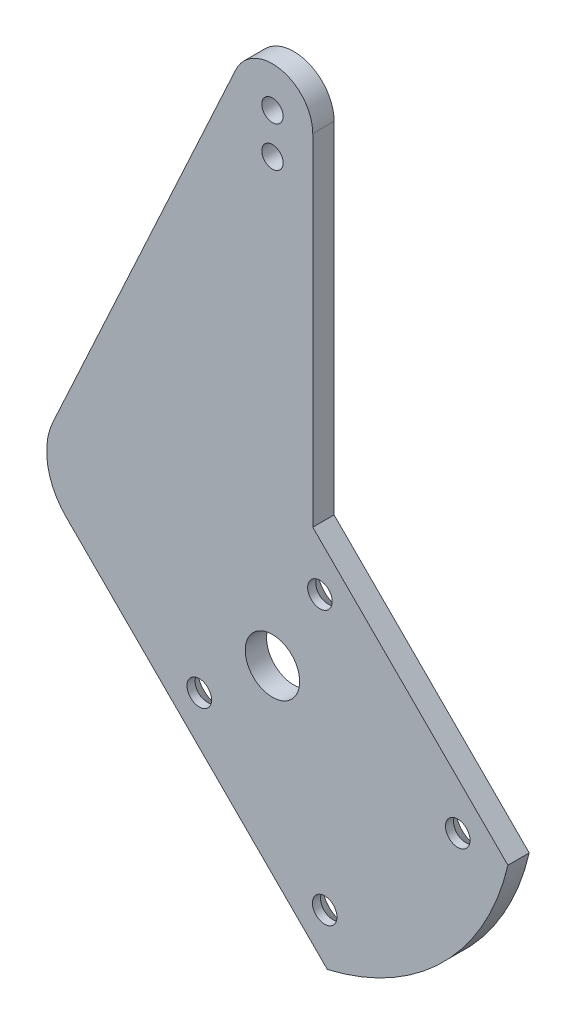
ISO-10303-21;
HEADER;
FILE_DESCRIPTION(('STEP AP214'),'2;1');
FILE_NAME('part.step','',(''),(''),'','','');
FILE_SCHEMA(('AUTOMOTIVE_DESIGN { 1 0 10303 214 1 1 1 1 }'));
ENDSEC;
DATA;
#1=APPLICATION_CONTEXT('core data for automotive mechanical design processes');
#2=APPLICATION_PROTOCOL_DEFINITION('international standard','automotive_design',2000,#1);
#3=PRODUCT_CONTEXT('',#1,'mechanical');
#4=PRODUCT('Part','Part','',(#3));
#5=PRODUCT_RELATED_PRODUCT_CATEGORY('part','',(#4));
#6=PRODUCT_DEFINITION_FORMATION('','',#4);
#7=PRODUCT_DEFINITION_CONTEXT('part definition',#1,'design');
#8=PRODUCT_DEFINITION('design','',#6,#7);
#9=PRODUCT_DEFINITION_SHAPE('','',#8);
#10=(LENGTH_UNIT() NAMED_UNIT(*) SI_UNIT(.MILLI.,.METRE.));
#11=(NAMED_UNIT(*) PLANE_ANGLE_UNIT() SI_UNIT($,.RADIAN.));
#12=(NAMED_UNIT(*) SI_UNIT($,.STERADIAN.) SOLID_ANGLE_UNIT());
#13=UNCERTAINTY_MEASURE_WITH_UNIT(LENGTH_MEASURE(1.E-05),#10,'distance_accuracy_value','');
#14=(GEOMETRIC_REPRESENTATION_CONTEXT(3) GLOBAL_UNCERTAINTY_ASSIGNED_CONTEXT((#13)) GLOBAL_UNIT_ASSIGNED_CONTEXT((#10,
#11,#12)) REPRESENTATION_CONTEXT('',''));
#15=CARTESIAN_POINT('',(0.,0.,0.));
#16=DIRECTION('',(0.,0.,1.));
#17=DIRECTION('',(1.,0.,0.));
#18=AXIS2_PLACEMENT_3D('',#15,#16,#17);
#19=CARTESIAN_POINT('',(0.,0.,-3.175));
#20=DIRECTION('',(0.,0.,1.));
#21=DIRECTION('',(1.,0.,0.));
#22=AXIS2_PLACEMENT_3D('',#19,#20,#21);
#23=CYLINDRICAL_SURFACE('',#22,35.98);
#24=CARTESIAN_POINT('',(0.,0.,0.));
#25=DIRECTION('',(0.,0.,1.));
#26=DIRECTION('',(1.,0.,0.));
#27=AXIS2_PLACEMENT_3D('',#24,#25,#26);
#28=CIRCLE('',#27,35.98);
#29=CARTESIAN_POINT('',(8.1700677783916,-35.040125463481,0.));
#30=VERTEX_POINT('',#29);
#31=CARTESIAN_POINT('',(35.0401254634808,-8.1700677783925,0.));
#32=VERTEX_POINT('',#31);
#33=EDGE_CURVE('E152',#30,#32,#28,.T.);
#34=ORIENTED_EDGE('',*,*,#33,.F.);
#35=DIRECTION('',(0.,0.,1.));
#36=VECTOR('',#35,1.);
#37=CARTESIAN_POINT('',(8.1700677783916,-35.040125463481,-3.175));
#38=LINE('',#37,#36);
#39=CARTESIAN_POINT('',(8.1700677783916,-35.040125463481,-3.175));
#40=VERTEX_POINT('',#39);
#41=EDGE_CURVE('E132',#40,#30,#38,.T.);
#42=ORIENTED_EDGE('',*,*,#41,.F.);
#43=CARTESIAN_POINT('',(0.,0.,-3.175));
#44=DIRECTION('',(0.,0.,1.));
#45=DIRECTION('',(1.,0.,0.));
#46=AXIS2_PLACEMENT_3D('',#43,#44,#45);
#47=CIRCLE('',#46,35.98);
#48=CARTESIAN_POINT('',(35.0401254634808,-8.1700677783925,-3.175));
#49=VERTEX_POINT('',#48);
#50=EDGE_CURVE('E125',#40,#49,#47,.T.);
#51=ORIENTED_EDGE('',*,*,#50,.T.);
#52=DIRECTION('',(0.,0.,1.));
#53=VECTOR('',#52,1.);
#54=CARTESIAN_POINT('',(35.0401254634808,-8.1700677783925,-3.175));
#55=LINE('',#54,#53);
#56=EDGE_CURVE('E108',#49,#32,#55,.T.);
#57=ORIENTED_EDGE('',*,*,#56,.T.);
#58=EDGE_LOOP('',(#34,#42,#51,#57));
#59=FACE_BOUND('',#58,.T.);
#60=ADVANCED_FACE('F45',(#59),#23,.T.);
#61=CARTESIAN_POINT('',(8.1700677783916,-35.040125463481,-3.175));
#62=DIRECTION('',(-0.707106781186556,-0.707106781186538,0.));
#63=DIRECTION('',(0.707106781186538,-0.707106781186557,0.));
#64=AXIS2_PLACEMENT_3D('',#61,#62,#63);
#65=PLANE('',#64);
#66=DIRECTION('',(0.707106781186539,-0.707106781186557,0.));
#67=VECTOR('',#66,1.);
#68=CARTESIAN_POINT('',(8.1700677783916,-35.040125463481,0.));
#69=LINE('',#68,#67);
#70=CARTESIAN_POINT('',(-30.6681423163192,3.79808463123082,0.));
#71=VERTEX_POINT('',#70);
#72=EDGE_CURVE('E133',#71,#30,#69,.T.);
#73=ORIENTED_EDGE('',*,*,#72,.F.);
#74=DIRECTION('',(0.,0.,1.));
#75=VECTOR('',#74,1.);
#76=CARTESIAN_POINT('',(-30.6681423163192,3.79808463123082,-3.175));
#77=LINE('',#76,#75);
#78=CARTESIAN_POINT('',(-30.6681423163192,3.79808463123082,-3.175));
#79=VERTEX_POINT('',#78);
#80=EDGE_CURVE('E53',#71,#79,#77,.F.);
#81=ORIENTED_EDGE('',*,*,#80,.T.);
#82=DIRECTION('',(0.707106781186539,-0.707106781186557,0.));
#83=VECTOR('',#82,1.);
#84=CARTESIAN_POINT('',(8.1700677783916,-35.040125463481,-3.175));
#85=LINE('',#84,#83);
#86=EDGE_CURVE('E119',#79,#40,#85,.T.);
#87=ORIENTED_EDGE('',*,*,#86,.T.);
#88=ORIENTED_EDGE('',*,*,#41,.T.);
#89=EDGE_LOOP('',(#73,#81,#87,#88));
#90=FACE_BOUND('',#89,.T.);
#91=ADVANCED_FACE('F219',(#90),#65,.T.);
#92=CARTESIAN_POINT('',(0.,0.,-3.175));
#93=DIRECTION('',(0.,0.,1.));
#94=DIRECTION('',(1.,0.,0.));
#95=AXIS2_PLACEMENT_3D('',#92,#93,#94);
#96=CYLINDRICAL_SURFACE('',#95,35.98);
#97=CARTESIAN_POINT('',(0.,0.,-3.175));
#98=DIRECTION('',(0.,0.,1.));
#99=DIRECTION('',(-1.,0.,0.));
#100=AXIS2_PLACEMENT_3D('',#97,#98,#99);
#101=CIRCLE('',#100,35.98);
#102=CARTESIAN_POINT('',(-32.6739835845964,15.0655632723614,-3.175));
#103=VERTEX_POINT('',#102);
#104=CARTESIAN_POINT('',(-32.6798591482002,15.0528138915551,-3.175));
#105=VERTEX_POINT('',#104);
#106=EDGE_CURVE('E148',#103,#105,#101,.T.);
#107=ORIENTED_EDGE('',*,*,#106,.T.);
#108=DIRECTION('',(0.,0.,1.));
#109=VECTOR('',#108,1.);
#110=CARTESIAN_POINT('',(-32.6798591482002,15.0528138915551,-3.175));
#111=LINE('',#110,#109);
#112=CARTESIAN_POINT('',(-32.6798591482002,15.0528138915551,0.));
#113=VERTEX_POINT('',#112);
#114=EDGE_CURVE('E167',#105,#113,#111,.T.);
#115=ORIENTED_EDGE('',*,*,#114,.T.);
#116=CARTESIAN_POINT('',(0.,0.,0.));
#117=DIRECTION('',(0.,0.,1.));
#118=DIRECTION('',(-1.,0.,0.));
#119=AXIS2_PLACEMENT_3D('',#116,#117,#118);
#120=CIRCLE('',#119,35.98);
#121=CARTESIAN_POINT('',(-32.6739835845964,15.0655632723614,0.));
#122=VERTEX_POINT('',#121);
#123=EDGE_CURVE('E135',#122,#113,#120,.T.);
#124=ORIENTED_EDGE('',*,*,#123,.F.);
#125=DIRECTION('',(0.,0.,1.));
#126=VECTOR('',#125,1.);
#127=CARTESIAN_POINT('',(-32.6739835845964,15.0655632723614,-3.175));
#128=LINE('',#127,#126);
#129=EDGE_CURVE('E168',#103,#122,#128,.T.);
#130=ORIENTED_EDGE('',*,*,#129,.F.);
#131=EDGE_LOOP('',(#107,#115,#124,#130));
#132=FACE_BOUND('',#131,.T.);
#133=ADVANCED_FACE('F200',(#132),#96,.T.);
#134=CARTESIAN_POINT('',(-5.44869098131124,74.1113983018102,-3.175));
#135=DIRECTION('',(-0.908115163551873,0.418720491171801,0.));
#136=DIRECTION('',(-0.418720491171801,-0.908115163551873,0.));
#137=AXIS2_PLACEMENT_3D('',#134,#135,#136);
#138=PLANE('',#137);
#139=DIRECTION('',(-0.418720491171801,-0.908115163551873,0.));
#140=VECTOR('',#139,1.);
#141=CARTESIAN_POINT('',(-5.44869098131124,74.1113983018102,0.));
#142=LINE('',#141,#140);
#143=CARTESIAN_POINT('',(-5.44869098131124,74.1113983018102,0.));
#144=VERTEX_POINT('',#143);
#145=EDGE_CURVE('E162',#144,#122,#142,.T.);
#146=ORIENTED_EDGE('',*,*,#145,.F.);
#147=DIRECTION('',(0.,0.,1.));
#148=VECTOR('',#147,1.);
#149=CARTESIAN_POINT('',(-5.44869098131124,74.1113983018102,-3.175));
#150=LINE('',#149,#148);
#151=CARTESIAN_POINT('',(-5.44869098131124,74.1113983018102,-3.175));
#152=VERTEX_POINT('',#151);
#153=EDGE_CURVE('E170',#152,#144,#150,.T.);
#154=ORIENTED_EDGE('',*,*,#153,.F.);
#155=DIRECTION('',(-0.418720491171801,-0.908115163551873,0.));
#156=VECTOR('',#155,1.);
#157=CARTESIAN_POINT('',(-5.44869098131124,74.1113983018102,-3.175));
#158=LINE('',#157,#156);
#159=EDGE_CURVE('E145',#152,#103,#158,.T.);
#160=ORIENTED_EDGE('',*,*,#159,.T.);
#161=ORIENTED_EDGE('',*,*,#129,.T.);
#162=EDGE_LOOP('',(#146,#154,#160,#161));
#163=FACE_BOUND('',#162,.T.);
#164=ADVANCED_FACE('F208',(#163),#138,.T.);
#165=CARTESIAN_POINT('',(0.,71.5990753547794,-3.175));
#166=DIRECTION('',(0.,0.,1.));
#167=DIRECTION('',(1.,0.,0.));
#168=AXIS2_PLACEMENT_3D('',#165,#166,#167);
#169=CYLINDRICAL_SURFACE('',#168,6.);
#170=CARTESIAN_POINT('',(0.,71.5990753547794,0.));
#171=DIRECTION('',(0.,0.,1.));
#172=DIRECTION('',(-1.,0.,0.));
#173=AXIS2_PLACEMENT_3D('',#170,#171,#172);
#174=CIRCLE('',#173,6.);
#175=CARTESIAN_POINT('',(6.,71.5990753547794,0.));
#176=VERTEX_POINT('',#175);
#177=EDGE_CURVE('E159',#176,#144,#174,.T.);
#178=ORIENTED_EDGE('',*,*,#177,.F.);
#179=DIRECTION('',(0.,0.,1.));
#180=VECTOR('',#179,1.);
#181=CARTESIAN_POINT('',(6.,71.5990753547794,-3.175));
#182=LINE('',#181,#180);
#183=CARTESIAN_POINT('',(6.,71.5990753547794,-3.175));
#184=VERTEX_POINT('',#183);
#185=EDGE_CURVE('E172',#184,#176,#182,.T.);
#186=ORIENTED_EDGE('',*,*,#185,.F.);
#187=CARTESIAN_POINT('',(0.,71.5990753547794,-3.175));
#188=DIRECTION('',(0.,0.,1.));
#189=DIRECTION('',(-1.,0.,0.));
#190=AXIS2_PLACEMENT_3D('',#187,#188,#189);
#191=CIRCLE('',#190,6.);
#192=EDGE_CURVE('E142',#184,#152,#191,.T.);
#193=ORIENTED_EDGE('',*,*,#192,.T.);
#194=ORIENTED_EDGE('',*,*,#153,.T.);
#195=EDGE_LOOP('',(#178,#186,#193,#194));
#196=FACE_BOUND('',#195,.T.);
#197=ADVANCED_FACE('F230',(#196),#169,.T.);
#198=CARTESIAN_POINT('',(6.,71.5990753547794,-3.175));
#199=DIRECTION('',(1.,0.,0.));
#200=DIRECTION('',(0.,1.,0.));
#201=AXIS2_PLACEMENT_3D('',#198,#199,#200);
#202=PLANE('',#201);
#203=DIRECTION('',(0.,1.,0.));
#204=VECTOR('',#203,1.);
#205=CARTESIAN_POINT('',(6.,71.5990753547794,0.));
#206=LINE('',#205,#204);
#207=CARTESIAN_POINT('',(6.00000000000001,20.870057685089,0.));
#208=VERTEX_POINT('',#207);
#209=EDGE_CURVE('E156',#208,#176,#206,.T.);
#210=ORIENTED_EDGE('',*,*,#209,.F.);
#211=DIRECTION('',(0.,0.,1.));
#212=VECTOR('',#211,1.);
#213=CARTESIAN_POINT('',(6.00000000000001,20.870057685089,-3.175));
#214=LINE('',#213,#212);
#215=CARTESIAN_POINT('',(6.00000000000001,20.870057685089,-3.175));
#216=VERTEX_POINT('',#215);
#217=EDGE_CURVE('E118',#216,#208,#214,.T.);
#218=ORIENTED_EDGE('',*,*,#217,.F.);
#219=DIRECTION('',(0.,1.,0.));
#220=VECTOR('',#219,1.);
#221=CARTESIAN_POINT('',(6.,71.5990753547794,-3.175));
#222=LINE('',#221,#220);
#223=EDGE_CURVE('E128',#216,#184,#222,.T.);
#224=ORIENTED_EDGE('',*,*,#223,.T.);
#225=ORIENTED_EDGE('',*,*,#185,.T.);
#226=EDGE_LOOP('',(#210,#218,#224,#225));
#227=FACE_BOUND('',#226,.T.);
#228=ADVANCED_FACE('F227',(#227),#202,.T.);
#229=CARTESIAN_POINT('',(6.00000000000001,20.870057685089,-3.175));
#230=DIRECTION('',(0.707106781186556,0.707106781186538,0.));
#231=DIRECTION('',(-0.707106781186538,0.707106781186557,0.));
#232=AXIS2_PLACEMENT_3D('',#229,#230,#231);
#233=PLANE('',#232);
#234=DIRECTION('',(-0.707106781186539,0.707106781186557,0.));
#235=VECTOR('',#234,1.);
#236=CARTESIAN_POINT('',(6.00000000000001,20.870057685089,0.));
#237=LINE('',#236,#235);
#238=EDGE_CURVE('E113',#32,#208,#237,.T.);
#239=ORIENTED_EDGE('',*,*,#238,.F.);
#240=ORIENTED_EDGE('',*,*,#56,.F.);
#241=DIRECTION('',(-0.707106781186539,0.707106781186557,0.));
#242=VECTOR('',#241,1.);
#243=CARTESIAN_POINT('',(6.00000000000001,20.870057685089,-3.175));
#244=LINE('',#243,#242);
#245=EDGE_CURVE('E111',#49,#216,#244,.T.);
#246=ORIENTED_EDGE('',*,*,#245,.T.);
#247=ORIENTED_EDGE('',*,*,#217,.T.);
#248=EDGE_LOOP('',(#239,#240,#246,#247));
#249=FACE_BOUND('',#248,.T.);
#250=ADVANCED_FACE('F110',(#249),#233,.T.);
#251=CARTESIAN_POINT('',(0.,0.,-3.175));
#252=DIRECTION('',(0.,0.,1.));
#253=DIRECTION('',(1.,0.,0.));
#254=AXIS2_PLACEMENT_3D('',#251,#252,#253);
#255=PLANE('',#254);
#256=CARTESIAN_POINT('',(7.07106781186564,12.7279220613578,-3.175));
#257=DIRECTION('',(0.,0.,-1.));
#258=DIRECTION('',(-1.,0.,0.));
#259=AXIS2_PLACEMENT_3D('',#256,#257,#258);
#260=CIRCLE('',#259,3.5433);
#261=CARTESIAN_POINT('',(3.52776781186564,12.7279220613578,-3.175));
#262=VERTEX_POINT('',#261);
#263=EDGE_CURVE('E289',#262,#262,#260,.T.);
#264=ORIENTED_EDGE('',*,*,#263,.F.);
#265=EDGE_LOOP('',(#264));
#266=FACE_BOUND('',#265,.T.);
#267=CARTESIAN_POINT('',(27.5771644662753,-7.77817459305237,-3.175));
#268=DIRECTION('',(0.,0.,-1.));
#269=DIRECTION('',(-1.,0.,0.));
#270=AXIS2_PLACEMENT_3D('',#267,#268,#269);
#271=CIRCLE('',#270,3.5433);
#272=CARTESIAN_POINT('',(24.0338644662753,-7.77817459305237,-3.175));
#273=VERTEX_POINT('',#272);
#274=EDGE_CURVE('E193',#273,#273,#271,.T.);
#275=ORIENTED_EDGE('',*,*,#274,.F.);
#276=EDGE_LOOP('',(#275));
#277=FACE_BOUND('',#276,.T.);
#278=CARTESIAN_POINT('',(-10.8866160031482,-8.91237387007511,-3.175));
#279=DIRECTION('',(0.,0.,-1.));
#280=DIRECTION('',(-1.,0.,0.));
#281=AXIS2_PLACEMENT_3D('',#278,#279,#280);
#282=CIRCLE('',#281,3.5433);
#283=CARTESIAN_POINT('',(-14.4299160031482,-8.91237387007511,-3.175));
#284=VERTEX_POINT('',#283);
#285=EDGE_CURVE('E188',#284,#284,#282,.T.);
#286=ORIENTED_EDGE('',*,*,#285,.F.);
#287=EDGE_LOOP('',(#286));
#288=FACE_BOUND('',#287,.T.);
#289=CARTESIAN_POINT('',(7.77817459305237,-27.5771644662753,-3.175));
#290=DIRECTION('',(0.,0.,-1.));
#291=DIRECTION('',(-1.,0.,0.));
#292=AXIS2_PLACEMENT_3D('',#289,#290,#291);
#293=CIRCLE('',#292,3.5433);
#294=CARTESIAN_POINT('',(4.23487459305237,-27.5771644662753,-3.175));
#295=VERTEX_POINT('',#294);
#296=EDGE_CURVE('E183',#295,#295,#293,.T.);
#297=ORIENTED_EDGE('',*,*,#296,.F.);
#298=EDGE_LOOP('',(#297));
#299=FACE_BOUND('',#298,.T.);
#300=CARTESIAN_POINT('',(0.,0.,-3.175));
#301=DIRECTION('',(0.,0.,1.));
#302=DIRECTION('',(1.,0.,0.));
#303=AXIS2_PLACEMENT_3D('',#300,#301,#302);
#304=CIRCLE('',#303,4.05);
#305=CARTESIAN_POINT('',(4.05,0.,-3.175));
#306=VERTEX_POINT('',#305);
#307=EDGE_CURVE('E306',#306,#306,#304,.T.);
#308=ORIENTED_EDGE('',*,*,#307,.T.);
#309=EDGE_LOOP('',(#308));
#310=FACE_BOUND('',#309,.T.);
#311=CARTESIAN_POINT('',(0.,65.5990753547794,-3.175));
#312=DIRECTION('',(0.,0.,1.));
#313=DIRECTION('',(1.,0.,0.));
#314=AXIS2_PLACEMENT_3D('',#311,#312,#313);
#315=CIRCLE('',#314,1.5875);
#316=CARTESIAN_POINT('',(1.5875,65.5990753547794,-3.175));
#317=VERTEX_POINT('',#316);
#318=EDGE_CURVE('E312',#317,#317,#315,.T.);
#319=ORIENTED_EDGE('',*,*,#318,.T.);
#320=EDGE_LOOP('',(#319));
#321=FACE_BOUND('',#320,.T.);
#322=CARTESIAN_POINT('',(0.,71.5990753547794,-3.175));
#323=DIRECTION('',(0.,0.,1.));
#324=DIRECTION('',(1.,0.,0.));
#325=AXIS2_PLACEMENT_3D('',#322,#323,#324);
#326=CIRCLE('',#325,1.5875);
#327=CARTESIAN_POINT('',(1.5875,71.5990753547794,-3.175));
#328=VERTEX_POINT('',#327);
#329=EDGE_CURVE('E154',#328,#328,#326,.T.);
#330=ORIENTED_EDGE('',*,*,#329,.T.);
#331=EDGE_LOOP('',(#330));
#332=FACE_BOUND('',#331,.T.);
#333=ORIENTED_EDGE('',*,*,#86,.F.);
#334=CARTESIAN_POINT('',(-23.5970745044536,10.8691524430962,-3.175));
#335=DIRECTION('',(0.,0.,1.));
#336=DIRECTION('',(1.,0.,0.));
#337=AXIS2_PLACEMENT_3D('',#334,#335,#336);
#338=CIRCLE('',#337,10.);
#339=EDGE_CURVE('E13',#79,#105,#338,.F.);
#340=ORIENTED_EDGE('',*,*,#339,.T.);
#341=ORIENTED_EDGE('',*,*,#106,.F.);
#342=ORIENTED_EDGE('',*,*,#159,.F.);
#343=ORIENTED_EDGE('',*,*,#192,.F.);
#344=ORIENTED_EDGE('',*,*,#223,.F.);
#345=ORIENTED_EDGE('',*,*,#245,.F.);
#346=ORIENTED_EDGE('',*,*,#50,.F.);
#347=EDGE_LOOP('',(#333,#340,#341,#342,#343,#344,#345,#346));
#348=FACE_BOUND('',#347,.T.);
#349=ADVANCED_FACE('F124',(#266,#277,#288,#299,#310,#321,#332,#348),#255,.F.);
#350=CARTESIAN_POINT('',(0.,0.,0.));
#351=DIRECTION('',(0.,0.,1.));
#352=DIRECTION('',(1.,0.,0.));
#353=AXIS2_PLACEMENT_3D('',#350,#351,#352);
#354=PLANE('',#353);
#355=CARTESIAN_POINT('',(7.07106781186564,12.7279220613578,0.));
#356=DIRECTION('',(0.,0.,1.));
#357=DIRECTION('',(1.,0.,0.));
#358=AXIS2_PLACEMENT_3D('',#355,#356,#357);
#359=CIRCLE('',#358,1.8288);
#360=CARTESIAN_POINT('',(8.89986781186563,12.7279220613578,0.));
#361=VERTEX_POINT('',#360);
#362=EDGE_CURVE('E190',#361,#361,#359,.T.);
#363=ORIENTED_EDGE('',*,*,#362,.F.);
#364=EDGE_LOOP('',(#363));
#365=FACE_BOUND('',#364,.T.);
#366=CARTESIAN_POINT('',(27.5771644662753,-7.77817459305237,0.));
#367=DIRECTION('',(0.,0.,1.));
#368=DIRECTION('',(1.,0.,0.));
#369=AXIS2_PLACEMENT_3D('',#366,#367,#368);
#370=CIRCLE('',#369,1.8288);
#371=CARTESIAN_POINT('',(29.4059644662753,-7.77817459305237,0.));
#372=VERTEX_POINT('',#371);
#373=EDGE_CURVE('E185',#372,#372,#370,.T.);
#374=ORIENTED_EDGE('',*,*,#373,.F.);
#375=EDGE_LOOP('',(#374));
#376=FACE_BOUND('',#375,.T.);
#377=CARTESIAN_POINT('',(-10.8866160031482,-8.91237387007511,0.));
#378=DIRECTION('',(0.,0.,1.));
#379=DIRECTION('',(1.,0.,0.));
#380=AXIS2_PLACEMENT_3D('',#377,#378,#379);
#381=CIRCLE('',#380,1.8288);
#382=CARTESIAN_POINT('',(-9.0578160031482,-8.91237387007511,0.));
#383=VERTEX_POINT('',#382);
#384=EDGE_CURVE('E180',#383,#383,#381,.T.);
#385=ORIENTED_EDGE('',*,*,#384,.F.);
#386=EDGE_LOOP('',(#385));
#387=FACE_BOUND('',#386,.T.);
#388=CARTESIAN_POINT('',(7.77817459305237,-27.5771644662753,0.));
#389=DIRECTION('',(0.,0.,1.));
#390=DIRECTION('',(1.,0.,0.));
#391=AXIS2_PLACEMENT_3D('',#388,#389,#390);
#392=CIRCLE('',#391,1.8288);
#393=CARTESIAN_POINT('',(9.60697459305237,-27.5771644662753,0.));
#394=VERTEX_POINT('',#393);
#395=EDGE_CURVE('E175',#394,#394,#392,.T.);
#396=ORIENTED_EDGE('',*,*,#395,.F.);
#397=EDGE_LOOP('',(#396));
#398=FACE_BOUND('',#397,.T.);
#399=CARTESIAN_POINT('',(0.,0.,0.));
#400=DIRECTION('',(0.,0.,1.));
#401=DIRECTION('',(1.,0.,0.));
#402=AXIS2_PLACEMENT_3D('',#399,#400,#401);
#403=CIRCLE('',#402,4.05);
#404=CARTESIAN_POINT('',(4.05,0.,0.));
#405=VERTEX_POINT('',#404);
#406=EDGE_CURVE('E178',#405,#405,#403,.T.);
#407=ORIENTED_EDGE('',*,*,#406,.F.);
#408=EDGE_LOOP('',(#407));
#409=FACE_BOUND('',#408,.T.);
#410=CARTESIAN_POINT('',(0.,65.5990753547794,0.));
#411=DIRECTION('',(0.,0.,1.));
#412=DIRECTION('',(1.,0.,0.));
#413=AXIS2_PLACEMENT_3D('',#410,#411,#412);
#414=CIRCLE('',#413,1.5875);
#415=CARTESIAN_POINT('',(1.5875,65.5990753547794,0.));
#416=VERTEX_POINT('',#415);
#417=EDGE_CURVE('E309',#416,#416,#414,.T.);
#418=ORIENTED_EDGE('',*,*,#417,.F.);
#419=EDGE_LOOP('',(#418));
#420=FACE_BOUND('',#419,.T.);
#421=CARTESIAN_POINT('',(0.,71.5990753547794,0.));
#422=DIRECTION('',(0.,0.,1.));
#423=DIRECTION('',(1.,0.,0.));
#424=AXIS2_PLACEMENT_3D('',#421,#422,#423);
#425=CIRCLE('',#424,1.5875);
#426=CARTESIAN_POINT('',(1.5875,71.5990753547794,0.));
#427=VERTEX_POINT('',#426);
#428=EDGE_CURVE('E138',#427,#427,#425,.T.);
#429=ORIENTED_EDGE('',*,*,#428,.F.);
#430=EDGE_LOOP('',(#429));
#431=FACE_BOUND('',#430,.T.);
#432=ORIENTED_EDGE('',*,*,#123,.T.);
#433=CARTESIAN_POINT('',(-23.5970745044536,10.8691524430962,0.));
#434=DIRECTION('',(0.,0.,1.));
#435=DIRECTION('',(1.,0.,0.));
#436=AXIS2_PLACEMENT_3D('',#433,#434,#435);
#437=CIRCLE('',#436,10.);
#438=EDGE_CURVE('E67',#113,#71,#437,.T.);
#439=ORIENTED_EDGE('',*,*,#438,.T.);
#440=ORIENTED_EDGE('',*,*,#72,.T.);
#441=ORIENTED_EDGE('',*,*,#33,.T.);
#442=ORIENTED_EDGE('',*,*,#238,.T.);
#443=ORIENTED_EDGE('',*,*,#209,.T.);
#444=ORIENTED_EDGE('',*,*,#177,.T.);
#445=ORIENTED_EDGE('',*,*,#145,.T.);
#446=EDGE_LOOP('',(#432,#439,#440,#441,#442,#443,#444,#445));
#447=FACE_BOUND('',#446,.T.);
#448=ADVANCED_FACE('F204',(#365,#376,#387,#398,#409,#420,#431,#447),#354,.T.);
#449=CARTESIAN_POINT('',(0.,71.5990753547794,-3.175));
#450=DIRECTION('',(0.,0.,1.));
#451=DIRECTION('',(1.,0.,0.));
#452=AXIS2_PLACEMENT_3D('',#449,#450,#451);
#453=CYLINDRICAL_SURFACE('',#452,1.5875);
#454=ORIENTED_EDGE('',*,*,#329,.F.);
#455=EDGE_LOOP('',(#454));
#456=FACE_BOUND('',#455,.T.);
#457=ORIENTED_EDGE('',*,*,#428,.T.);
#458=EDGE_LOOP('',(#457));
#459=FACE_BOUND('',#458,.T.);
#460=ADVANCED_FACE('F241',(#456,#459),#453,.F.);
#461=CARTESIAN_POINT('',(0.,65.5990753547794,-3.175));
#462=DIRECTION('',(0.,0.,1.));
#463=DIRECTION('',(1.,0.,0.));
#464=AXIS2_PLACEMENT_3D('',#461,#462,#463);
#465=CYLINDRICAL_SURFACE('',#464,1.5875);
#466=ORIENTED_EDGE('',*,*,#318,.F.);
#467=EDGE_LOOP('',(#466));
#468=FACE_BOUND('',#467,.T.);
#469=ORIENTED_EDGE('',*,*,#417,.T.);
#470=EDGE_LOOP('',(#469));
#471=FACE_BOUND('',#470,.T.);
#472=ADVANCED_FACE('F248',(#468,#471),#465,.F.);
#473=CARTESIAN_POINT('',(0.,0.,-3.175));
#474=DIRECTION('',(0.,0.,1.));
#475=DIRECTION('',(1.,0.,0.));
#476=AXIS2_PLACEMENT_3D('',#473,#474,#475);
#477=CYLINDRICAL_SURFACE('',#476,4.05);
#478=ORIENTED_EDGE('',*,*,#307,.F.);
#479=EDGE_LOOP('',(#478));
#480=FACE_BOUND('',#479,.T.);
#481=ORIENTED_EDGE('',*,*,#406,.T.);
#482=EDGE_LOOP('',(#481));
#483=FACE_BOUND('',#482,.T.);
#484=ADVANCED_FACE('F252',(#480,#483),#477,.F.);
#485=CARTESIAN_POINT('',(7.77817459305237,-27.5771644662753,-3.175));
#486=DIRECTION('',(0.,0.,-1.));
#487=DIRECTION('',(-1.,0.,0.));
#488=AXIS2_PLACEMENT_3D('',#485,#486,#487);
#489=CYLINDRICAL_SURFACE('',#488,1.8288);
#490=ORIENTED_EDGE('',*,*,#395,.T.);
#491=EDGE_LOOP('',(#490));
#492=FACE_BOUND('',#491,.T.);
#493=CARTESIAN_POINT('',(7.77817459305237,-27.5771644662753,-1.20269336581958));
#494=DIRECTION('',(0.,0.,-1.));
#495=DIRECTION('',(-1.,0.,0.));
#496=AXIS2_PLACEMENT_3D('',#493,#494,#495);
#497=CIRCLE('',#496,1.8288);
#498=CARTESIAN_POINT('',(5.94937459305237,-27.5771644662753,-1.20269336581958));
#499=VERTEX_POINT('',#498);
#500=EDGE_CURVE('E179',#499,#499,#497,.T.);
#501=ORIENTED_EDGE('',*,*,#500,.T.);
#502=EDGE_LOOP('',(#501));
#503=FACE_BOUND('',#502,.T.);
#504=ADVANCED_FACE('F256',(#492,#503),#489,.F.);
#505=CARTESIAN_POINT('',(7.77817459305237,-27.5771644662753,-3.175));
#506=DIRECTION('',(0.,0.,-1.));
#507=DIRECTION('',(-1.,0.,0.));
#508=AXIS2_PLACEMENT_3D('',#505,#506,#507);
#509=CONICAL_SURFACE('',#508,3.5433,0.715584993317675);
#510=ORIENTED_EDGE('',*,*,#500,.F.);
#511=EDGE_LOOP('',(#510));
#512=FACE_BOUND('',#511,.T.);
#513=ORIENTED_EDGE('',*,*,#296,.T.);
#514=EDGE_LOOP('',(#513));
#515=FACE_BOUND('',#514,.T.);
#516=ADVANCED_FACE('F260',(#512,#515),#509,.F.);
#517=CARTESIAN_POINT('',(-10.8866160031482,-8.91237387007511,-3.175));
#518=DIRECTION('',(0.,0.,-1.));
#519=DIRECTION('',(-1.,0.,0.));
#520=AXIS2_PLACEMENT_3D('',#517,#518,#519);
#521=CYLINDRICAL_SURFACE('',#520,1.8288);
#522=ORIENTED_EDGE('',*,*,#384,.T.);
#523=EDGE_LOOP('',(#522));
#524=FACE_BOUND('',#523,.T.);
#525=CARTESIAN_POINT('',(-10.8866160031482,-8.91237387007511,-1.20269336581958));
#526=DIRECTION('',(0.,0.,-1.));
#527=DIRECTION('',(-1.,0.,0.));
#528=AXIS2_PLACEMENT_3D('',#525,#526,#527);
#529=CIRCLE('',#528,1.8288);
#530=CARTESIAN_POINT('',(-12.7154160031482,-8.91237387007511,-1.20269336581958));
#531=VERTEX_POINT('',#530);
#532=EDGE_CURVE('E184',#531,#531,#529,.T.);
#533=ORIENTED_EDGE('',*,*,#532,.T.);
#534=EDGE_LOOP('',(#533));
#535=FACE_BOUND('',#534,.T.);
#536=ADVANCED_FACE('F264',(#524,#535),#521,.F.);
#537=CARTESIAN_POINT('',(-10.8866160031482,-8.91237387007511,-3.175));
#538=DIRECTION('',(0.,0.,-1.));
#539=DIRECTION('',(-1.,0.,0.));
#540=AXIS2_PLACEMENT_3D('',#537,#538,#539);
#541=CONICAL_SURFACE('',#540,3.5433,0.715584993317675);
#542=ORIENTED_EDGE('',*,*,#532,.F.);
#543=EDGE_LOOP('',(#542));
#544=FACE_BOUND('',#543,.T.);
#545=ORIENTED_EDGE('',*,*,#285,.T.);
#546=EDGE_LOOP('',(#545));
#547=FACE_BOUND('',#546,.T.);
#548=ADVANCED_FACE('F268',(#544,#547),#541,.F.);
#549=CARTESIAN_POINT('',(27.5771644662753,-7.77817459305237,-3.175));
#550=DIRECTION('',(0.,0.,-1.));
#551=DIRECTION('',(-1.,0.,0.));
#552=AXIS2_PLACEMENT_3D('',#549,#550,#551);
#553=CYLINDRICAL_SURFACE('',#552,1.8288);
#554=ORIENTED_EDGE('',*,*,#373,.T.);
#555=EDGE_LOOP('',(#554));
#556=FACE_BOUND('',#555,.T.);
#557=CARTESIAN_POINT('',(27.5771644662753,-7.77817459305237,-1.20269336581958));
#558=DIRECTION('',(0.,0.,-1.));
#559=DIRECTION('',(-1.,0.,0.));
#560=AXIS2_PLACEMENT_3D('',#557,#558,#559);
#561=CIRCLE('',#560,1.8288);
#562=CARTESIAN_POINT('',(25.7483644662753,-7.77817459305237,-1.20269336581958));
#563=VERTEX_POINT('',#562);
#564=EDGE_CURVE('E189',#563,#563,#561,.T.);
#565=ORIENTED_EDGE('',*,*,#564,.T.);
#566=EDGE_LOOP('',(#565));
#567=FACE_BOUND('',#566,.T.);
#568=ADVANCED_FACE('F272',(#556,#567),#553,.F.);
#569=CARTESIAN_POINT('',(27.5771644662753,-7.77817459305237,-3.175));
#570=DIRECTION('',(0.,0.,-1.));
#571=DIRECTION('',(-1.,0.,0.));
#572=AXIS2_PLACEMENT_3D('',#569,#570,#571);
#573=CONICAL_SURFACE('',#572,3.5433,0.715584993317675);
#574=ORIENTED_EDGE('',*,*,#564,.F.);
#575=EDGE_LOOP('',(#574));
#576=FACE_BOUND('',#575,.T.);
#577=ORIENTED_EDGE('',*,*,#274,.T.);
#578=EDGE_LOOP('',(#577));
#579=FACE_BOUND('',#578,.T.);
#580=ADVANCED_FACE('F276',(#576,#579),#573,.F.);
#581=CARTESIAN_POINT('',(7.07106781186564,12.7279220613578,-3.175));
#582=DIRECTION('',(0.,0.,-1.));
#583=DIRECTION('',(-1.,0.,0.));
#584=AXIS2_PLACEMENT_3D('',#581,#582,#583);
#585=CYLINDRICAL_SURFACE('',#584,1.8288);
#586=ORIENTED_EDGE('',*,*,#362,.T.);
#587=EDGE_LOOP('',(#586));
#588=FACE_BOUND('',#587,.T.);
#589=CARTESIAN_POINT('',(7.07106781186564,12.7279220613578,-1.20269336581958));
#590=DIRECTION('',(0.,0.,-1.));
#591=DIRECTION('',(-1.,0.,0.));
#592=AXIS2_PLACEMENT_3D('',#589,#590,#591);
#593=CIRCLE('',#592,1.8288);
#594=CARTESIAN_POINT('',(5.24226781186564,12.7279220613578,-1.20269336581958));
#595=VERTEX_POINT('',#594);
#596=EDGE_CURVE('E194',#595,#595,#593,.T.);
#597=ORIENTED_EDGE('',*,*,#596,.T.);
#598=EDGE_LOOP('',(#597));
#599=FACE_BOUND('',#598,.T.);
#600=ADVANCED_FACE('F215',(#588,#599),#585,.F.);
#601=CARTESIAN_POINT('',(7.07106781186564,12.7279220613578,-3.175));
#602=DIRECTION('',(0.,0.,-1.));
#603=DIRECTION('',(-1.,0.,0.));
#604=AXIS2_PLACEMENT_3D('',#601,#602,#603);
#605=CONICAL_SURFACE('',#604,3.5433,0.715584993317675);
#606=ORIENTED_EDGE('',*,*,#596,.F.);
#607=EDGE_LOOP('',(#606));
#608=FACE_BOUND('',#607,.T.);
#609=ORIENTED_EDGE('',*,*,#263,.T.);
#610=EDGE_LOOP('',(#609));
#611=FACE_BOUND('',#610,.T.);
#612=ADVANCED_FACE('F211',(#608,#611),#605,.F.);
#613=CARTESIAN_POINT('',(-23.5970745044536,10.8691524430962,-3.175));
#614=DIRECTION('',(0.,0.,1.));
#615=DIRECTION('',(1.,0.,0.));
#616=AXIS2_PLACEMENT_3D('',#613,#614,#615);
#617=CYLINDRICAL_SURFACE('',#616,10.);
#618=ORIENTED_EDGE('',*,*,#339,.F.);
#619=ORIENTED_EDGE('',*,*,#80,.F.);
#620=ORIENTED_EDGE('',*,*,#438,.F.);
#621=ORIENTED_EDGE('',*,*,#114,.F.);
#622=EDGE_LOOP('',(#618,#619,#620,#621));
#623=FACE_BOUND('',#622,.T.);
#624=ADVANCED_FACE('F47',(#623),#617,.T.);
#625=CLOSED_SHELL('',(#60,#91,#133,#164,#197,#228,#250,#349,#448,#460,#472,#484,#504,#516,#536,
#548,#568,#580,#600,#612,#624));
#626=MANIFOLD_SOLID_BREP('B2',#625);
#627=ADVANCED_BREP_SHAPE_REPRESENTATION('',(#18,#626),#14);
#628=SHAPE_DEFINITION_REPRESENTATION(#9,#627);
ENDSEC;
END-ISO-10303-21;
